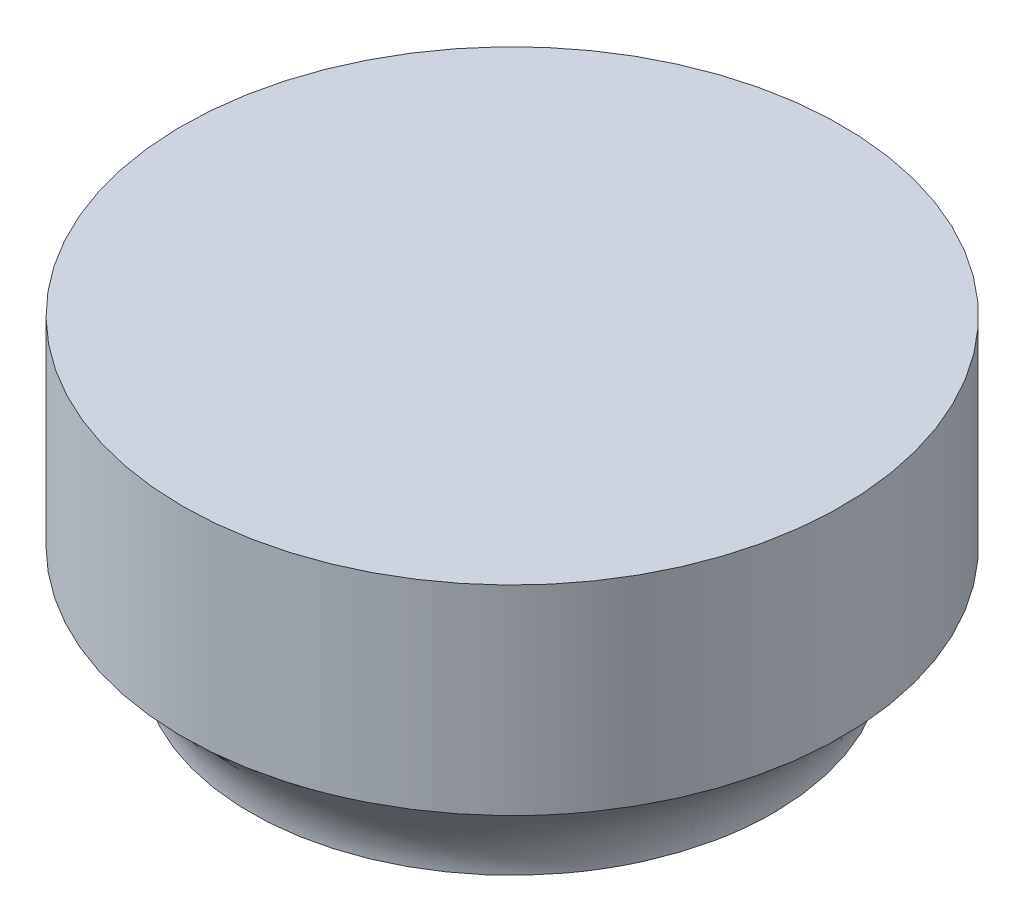
ISO-10303-21;
HEADER;
FILE_DESCRIPTION(('STEP AP214'),'2;1');
FILE_NAME('part.step','',(''),(''),'','','');
FILE_SCHEMA(('AUTOMOTIVE_DESIGN { 1 0 10303 214 1 1 1 1 }'));
ENDSEC;
DATA;
#1=APPLICATION_CONTEXT('core data for automotive mechanical design processes');
#2=APPLICATION_PROTOCOL_DEFINITION('international standard','automotive_design',2000,#1);
#3=PRODUCT_CONTEXT('',#1,'mechanical');
#4=PRODUCT('Part','Part','',(#3));
#5=PRODUCT_RELATED_PRODUCT_CATEGORY('part','',(#4));
#6=PRODUCT_DEFINITION_FORMATION('','',#4);
#7=PRODUCT_DEFINITION_CONTEXT('part definition',#1,'design');
#8=PRODUCT_DEFINITION('design','',#6,#7);
#9=PRODUCT_DEFINITION_SHAPE('','',#8);
#10=(LENGTH_UNIT() NAMED_UNIT(*) SI_UNIT(.MILLI.,.METRE.));
#11=(NAMED_UNIT(*) PLANE_ANGLE_UNIT() SI_UNIT($,.RADIAN.));
#12=(NAMED_UNIT(*) SI_UNIT($,.STERADIAN.) SOLID_ANGLE_UNIT());
#13=UNCERTAINTY_MEASURE_WITH_UNIT(LENGTH_MEASURE(1.E-05),#10,'distance_accuracy_value','');
#14=(GEOMETRIC_REPRESENTATION_CONTEXT(3) GLOBAL_UNCERTAINTY_ASSIGNED_CONTEXT((#13)) GLOBAL_UNIT_ASSIGNED_CONTEXT((#10,
#11,#12)) REPRESENTATION_CONTEXT('',''));
#15=CARTESIAN_POINT('',(0.,0.,0.));
#16=DIRECTION('',(0.,0.,1.));
#17=DIRECTION('',(1.,0.,0.));
#18=AXIS2_PLACEMENT_3D('',#15,#16,#17);
#19=CARTESIAN_POINT('',(0.,0.,0.));
#20=DIRECTION('',(0.,1.,0.));
#21=DIRECTION('',(0.,0.,1.));
#22=AXIS2_PLACEMENT_3D('',#19,#20,#21);
#23=PLANE('',#22);
#24=CARTESIAN_POINT('',(0.,0.,0.));
#25=DIRECTION('',(0.,1.,0.));
#26=DIRECTION('',(0.,0.,1.));
#27=AXIS2_PLACEMENT_3D('',#24,#25,#26);
#28=CIRCLE('',#27,32.75);
#29=CARTESIAN_POINT('',(-31.1343587669479,0.,-10.1594391661635));
#30=VERTEX_POINT('',#29);
#31=EDGE_CURVE('E50',#30,#30,#28,.T.);
#32=ORIENTED_EDGE('',*,*,#31,.F.);
#33=EDGE_LOOP('',(#32));
#34=FACE_BOUND('',#33,.T.);
#35=ADVANCED_FACE('F39',(#34),#23,.F.);
#36=CARTESIAN_POINT('',(-31.1343587669479,0.,-10.1594391661635));
#37=CARTESIAN_POINT('',(-23.8393133337541,12.499999892,-33.6944025733518));
#38=CARTESIAN_POINT('',(-51.4532370992749,0.,52.1092783677323));
#39=CARTESIAN_POINT('',(-91.2281184804576,12.499999892,13.9842240941563));
#40=CARTESIAN_POINT('',(10.8154804346209,0.,72.4281567000593));
#41=CARTESIAN_POINT('',(-43.5494918129495,12.499999892,81.3730292408599));
#42=CARTESIAN_POINT('',(31.1343587669479,0.,10.1594391661635));
#43=CARTESIAN_POINT('',(23.8393133337541,12.499999892,33.6944025733518));
#44=CARTESIAN_POINT('',(51.4532370992748,0.,-52.1092783677323));
#45=CARTESIAN_POINT('',(91.2281184804576,12.499999892,-13.9842240941563));
#46=CARTESIAN_POINT('',(-10.8154804346209,0.,-72.4281567000592));
#47=CARTESIAN_POINT('',(43.5494918129495,12.499999892,-81.3730292408599));
#48=CARTESIAN_POINT('',(-31.1343587669479,0.,-10.1594391661635));
#49=CARTESIAN_POINT('',(-23.8393133337541,12.499999892,-33.6944025733518));
#50=(BOUNDED_SURFACE() B_SPLINE_SURFACE(3,1,((#36,#37),(#38,#39),(#40,#41),(#42,#43),(#44,#45),
(#46,#47),(#48,#49)),.UNSPECIFIED.,.T.,.F.,.F.) B_SPLINE_SURFACE_WITH_KNOTS((4,3,4),(2,2),(0.,
0.5,1.),(0.,1.),.UNSPECIFIED.) GEOMETRIC_REPRESENTATION_ITEM() RATIONAL_B_SPLINE_SURFACE(((1.,
1.),(0.333333333333333,0.333333333333334),(0.333333333333333,0.333333333333334),(1.,1.),
(0.333333333333333,0.333333333333333),(0.333333333333333,0.333333333333333),(1.,1.))) REPRESENTATION_ITEM('') SURFACE());
#51=CARTESIAN_POINT('',(0.,12.499999892,0.));
#52=DIRECTION('',(0.,1.,0.));
#53=DIRECTION('',(0.,0.,1.));
#54=AXIS2_PLACEMENT_3D('',#51,#52,#53);
#55=CIRCLE('',#54,41.275);
#56=CARTESIAN_POINT('',(-23.8393133337541,12.499999892,-33.6944025733518));
#57=VERTEX_POINT('',#56);
#58=EDGE_CURVE('E11',#57,#57,#55,.T.);
#59=CARTESIAN_POINT('',(-31.1343587669479,0.,-10.1594391661635));
#60=CARTESIAN_POINT('',(-31.0583687103521,0.130208332208334,-10.4045950349884));
#61=CARTESIAN_POINT('',(-30.9823786537563,0.260416664416667,-10.6497509038133));
#62=CARTESIAN_POINT('',(-30.8303985405648,0.520833328833333,-11.140062641463));
#63=CARTESIAN_POINT('',(-30.754408483969,0.651041661041666,-11.3852185102879));
#64=CARTESIAN_POINT('',(-30.6024283707775,0.911458325458333,-11.8755302479377));
#65=CARTESIAN_POINT('',(-30.5264383141817,1.04166665766667,-12.1206861167625));
#66=CARTESIAN_POINT('',(-30.3744582009902,1.30208332208333,-12.6109978544123));
#67=CARTESIAN_POINT('',(-30.2984681443944,1.43229165429167,-12.8561537232372));
#68=CARTESIAN_POINT('',(-30.1464880312029,1.69270831870833,-13.3464654608869));
#69=CARTESIAN_POINT('',(-30.0704979746071,1.82291665091667,-13.5916213297118));
#70=CARTESIAN_POINT('',(-29.9185178614156,2.08333331533333,-14.0819330673616));
#71=CARTESIAN_POINT('',(-29.8425278048198,2.21354164754167,-14.3270889361864));
#72=CARTESIAN_POINT('',(-29.6905476916283,2.47395831195833,-14.8174006738362));
#73=CARTESIAN_POINT('',(-29.6145576350325,2.60416664416667,-15.0625565426611));
#74=CARTESIAN_POINT('',(-29.462577521841,2.86458330858333,-15.5528682803108));
#75=CARTESIAN_POINT('',(-29.3865874652452,2.99479164079167,-15.7980241491357));
#76=CARTESIAN_POINT('',(-29.2346073520536,3.25520830520833,-16.2883358867855));
#77=CARTESIAN_POINT('',(-29.1586172954579,3.38541663741667,-16.5334917556103));
#78=CARTESIAN_POINT('',(-29.0066371822663,3.64583330183333,-17.0238034932601));
#79=CARTESIAN_POINT('',(-28.9306471256706,3.77604163404167,-17.268959362085));
#80=CARTESIAN_POINT('',(-28.778667012479,4.03645829845833,-17.7592710997347));
#81=CARTESIAN_POINT('',(-28.7026769558833,4.16666663066667,-18.0044269685596));
#82=CARTESIAN_POINT('',(-28.5506968426917,4.42708329508333,-18.4947387062094));
#83=CARTESIAN_POINT('',(-28.474706786096,4.55729162729167,-18.7398945750342));
#84=CARTESIAN_POINT('',(-28.3227266729044,4.81770829170833,-19.230206312684));
#85=CARTESIAN_POINT('',(-28.2467366163087,4.94791662391667,-19.4753621815089));
#86=CARTESIAN_POINT('',(-28.0947565031171,5.20833328833333,-19.9656739191586));
#87=CARTESIAN_POINT('',(-28.0187664465213,5.33854162054167,-20.2108297879835));
#88=CARTESIAN_POINT('',(-27.8667863333298,5.59895828495833,-20.7011415256333));
#89=CARTESIAN_POINT('',(-27.790796276734,5.72916661716667,-20.9462973944581));
#90=CARTESIAN_POINT('',(-27.6388161635425,5.98958328158333,-21.4366091321079));
#91=CARTESIAN_POINT('',(-27.5628261069467,6.11979161379167,-21.6817650009328));
#92=CARTESIAN_POINT('',(-27.4108459937552,6.38020827820833,-22.1720767385825));
#93=CARTESIAN_POINT('',(-27.3348559371594,6.51041661041667,-22.4172326074074));
#94=CARTESIAN_POINT('',(-27.1828758239679,6.77083327483333,-22.9075443450572));
#95=CARTESIAN_POINT('',(-27.1068857673721,6.90104160704167,-23.152700213882));
#96=CARTESIAN_POINT('',(-26.9549056541806,7.16145827145833,-23.6430119515318));
#97=CARTESIAN_POINT('',(-26.8789155975848,7.29166660366667,-23.8881678203567));
#98=CARTESIAN_POINT('',(-26.7269354843933,7.55208326808333,-24.3784795580064));
#99=CARTESIAN_POINT('',(-26.6509454277975,7.68229160029167,-24.6236354268313));
#100=CARTESIAN_POINT('',(-26.498965314606,7.94270826470833,-25.1139471644811));
#101=CARTESIAN_POINT('',(-26.4229752580102,8.07291659691667,-25.3591030333059));
#102=CARTESIAN_POINT('',(-26.2709951448187,8.33333326133333,-25.8494147709557));
#103=CARTESIAN_POINT('',(-26.1950050882229,8.46354159354166,-26.0945706397806));
#104=CARTESIAN_POINT('',(-26.0430249750314,8.72395825795833,-26.5848823774303));
#105=CARTESIAN_POINT('',(-25.9670349184356,8.85416659016667,-26.8300382462552));
#106=CARTESIAN_POINT('',(-25.8150548052441,9.11458325458333,-27.320349983905));
#107=CARTESIAN_POINT('',(-25.7390647486483,9.24479158679167,-27.5655058527298));
#108=CARTESIAN_POINT('',(-25.5870846354568,9.50520825120833,-28.0558175903796));
#109=CARTESIAN_POINT('',(-25.511094578861,9.63541658341667,-28.3009734592045));
#110=CARTESIAN_POINT('',(-25.3591144656694,9.89583324783333,-28.7912851968542));
#111=CARTESIAN_POINT('',(-25.2831244090737,10.0260415800417,-29.0364410656791));
#112=CARTESIAN_POINT('',(-25.1311442958821,10.2864582444583,-29.5267528033289));
#113=CARTESIAN_POINT('',(-25.0551542392864,10.4166665766667,-29.7719086721537));
#114=CARTESIAN_POINT('',(-24.9031741260948,10.6770832410833,-30.2622204098035));
#115=CARTESIAN_POINT('',(-24.8271840694991,10.8072915732917,-30.5073762786284));
#116=CARTESIAN_POINT('',(-24.6752039563075,11.0677082377083,-30.9976880162781));
#117=CARTESIAN_POINT('',(-24.5992138997118,11.1979165699167,-31.242843885103));
#118=CARTESIAN_POINT('',(-24.4472337865202,11.4583332343333,-31.7331556227528));
#119=CARTESIAN_POINT('',(-24.3712437299245,11.5885415665417,-31.9783114915776));
#120=CARTESIAN_POINT('',(-24.2192636167329,11.8489582309583,-32.4686232292274));
#121=CARTESIAN_POINT('',(-24.1432735601371,11.9791665631667,-32.7137790980523));
#122=CARTESIAN_POINT('',(-23.9912934469456,12.2395832275833,-33.204090835702));
#123=CARTESIAN_POINT('',(-23.9153033903498,12.3697915597917,-33.4492467045269));
#124=CARTESIAN_POINT('',(-23.8393133337541,12.499999892,-33.6944025733518));
#125=B_SPLINE_CURVE_WITH_KNOTS('',3,(#59,#60,#61,#62,#63,#64,#65,#66,#67,#68,#69,#70,#71,#72,
#73,#74,#75,#76,#77,#78,#79,#80,#81,#82,#83,#84,#85,#86,#87,#88,#89,#90,#91,#92,#93,#94,#95,#96,
#97,#98,#99,#100,#101,#102,#103,#104,#105,#106,#107,#108,#109,#110,#111,#112,#113,#114,#115,
#116,#117,#118,#119,#120,#121,#122,#123,#124),.UNSPECIFIED.,.F.,.F.,(4,2,2,2,2,2,2,2,2,2,2,2,2,
2,2,2,2,2,2,2,2,2,2,2,2,2,2,2,2,2,2,2,4),(0.,0.863406559202939,1.72681311840588,
2.59021967760882,3.45362623681176,4.3170327960147,5.18043935521764,6.04384591442058,
6.90725247362352,7.77065903282646,8.63406559202941,9.49747215123234,10.3608787104353,
11.2242852696382,12.0876918288412,12.9510983880441,13.814504947247,14.67791150645,
15.5413180656529,16.4047246248559,17.2681311840588,18.1315377432617,18.9949443024647,
19.8583508616676,20.7217574208706,21.5851639800735,22.4485705392765,23.3119770984794,
24.1753836576823,25.0387902168853,25.9021967760882,26.7656033352911,27.6290098944941),.UNSPECIFIED.);
#126=EDGE_CURVE('BSEAM41',#30,#57,#125,.T.);
#127=ORIENTED_EDGE('',*,*,#31,.T.);
#128=ORIENTED_EDGE('',*,*,#58,.F.);
#129=ORIENTED_EDGE('',*,*,#126,.T.);
#130=ORIENTED_EDGE('',*,*,#126,.F.);
#131=EDGE_LOOP('',(#127,#129,#128,#130));
#132=FACE_BOUND('',#131,.T.);
#133=ADVANCED_FACE('F41',(#132),#50,.T.);
#134=CARTESIAN_POINT('',(0.,37.499999892,0.));
#135=DIRECTION('',(0.,-1.,0.));
#136=DIRECTION('',(0.,0.,-1.));
#137=AXIS2_PLACEMENT_3D('',#134,#135,#136);
#138=CYLINDRICAL_SURFACE('',#137,41.275);
#139=CARTESIAN_POINT('',(0.,37.499999892,0.));
#140=DIRECTION('',(0.,1.,0.));
#141=DIRECTION('',(0.,0.,1.));
#142=AXIS2_PLACEMENT_3D('',#139,#140,#141);
#143=CIRCLE('',#142,41.275);
#144=CARTESIAN_POINT('',(0.,37.499999892,41.275));
#145=VERTEX_POINT('',#144);
#146=EDGE_CURVE('E55',#145,#145,#143,.T.);
#147=ORIENTED_EDGE('',*,*,#146,.F.);
#148=EDGE_LOOP('',(#147));
#149=FACE_BOUND('',#148,.T.);
#150=ORIENTED_EDGE('',*,*,#58,.T.);
#151=EDGE_LOOP('',(#150));
#152=FACE_BOUND('',#151,.T.);
#153=ADVANCED_FACE('F72',(#149,#152),#138,.T.);
#154=CARTESIAN_POINT('',(0.,37.499999892,0.));
#155=DIRECTION('',(0.,1.,0.));
#156=DIRECTION('',(0.,0.,1.));
#157=AXIS2_PLACEMENT_3D('',#154,#155,#156);
#158=PLANE('',#157);
#159=ORIENTED_EDGE('',*,*,#146,.T.);
#160=EDGE_LOOP('',(#159));
#161=FACE_BOUND('',#160,.T.);
#162=ADVANCED_FACE('F81',(#161),#158,.T.);
#163=CLOSED_SHELL('',(#35,#133,#153,#162));
#164=MANIFOLD_SOLID_BREP('B2',#163);
#165=ADVANCED_BREP_SHAPE_REPRESENTATION('',(#18,#164),#14);
#166=SHAPE_DEFINITION_REPRESENTATION(#9,#165);
ENDSEC;
END-ISO-10303-21;
